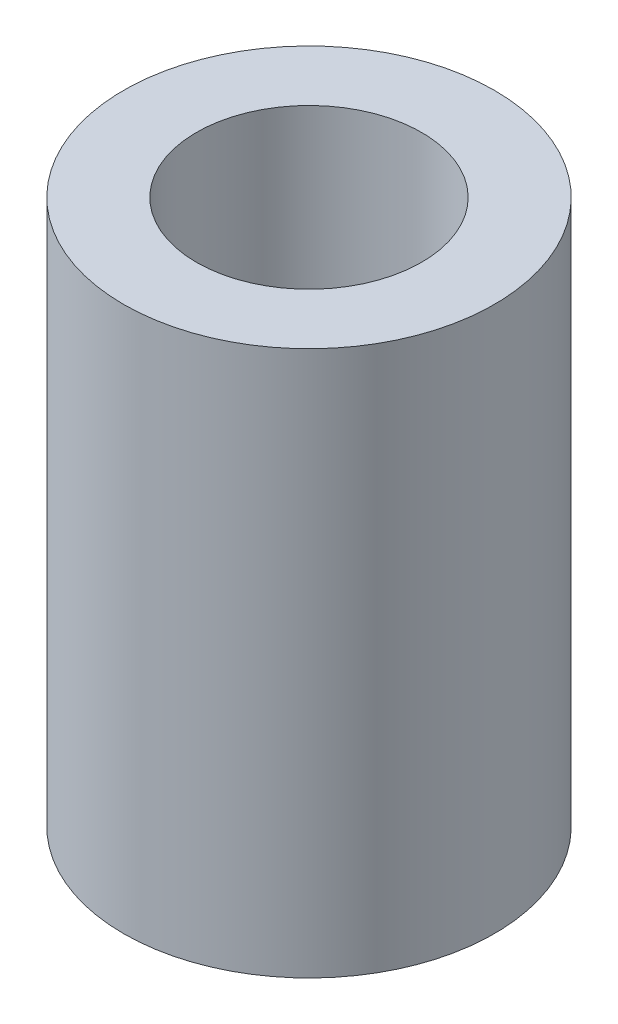
ISO-10303-21;
HEADER;
FILE_DESCRIPTION(('STEP AP214'),'2;1');
FILE_NAME('part.step','',(''),(''),'','','');
FILE_SCHEMA(('AUTOMOTIVE_DESIGN { 1 0 10303 214 1 1 1 1 }'));
ENDSEC;
DATA;
#1=APPLICATION_CONTEXT('core data for automotive mechanical design processes');
#2=APPLICATION_PROTOCOL_DEFINITION('international standard','automotive_design',2000,#1);
#3=PRODUCT_CONTEXT('',#1,'mechanical');
#4=PRODUCT('Part','Part','',(#3));
#5=PRODUCT_RELATED_PRODUCT_CATEGORY('part','',(#4));
#6=PRODUCT_DEFINITION_FORMATION('','',#4);
#7=PRODUCT_DEFINITION_CONTEXT('part definition',#1,'design');
#8=PRODUCT_DEFINITION('design','',#6,#7);
#9=PRODUCT_DEFINITION_SHAPE('','',#8);
#10=(LENGTH_UNIT() NAMED_UNIT(*) SI_UNIT(.MILLI.,.METRE.));
#11=(NAMED_UNIT(*) PLANE_ANGLE_UNIT() SI_UNIT($,.RADIAN.));
#12=(NAMED_UNIT(*) SI_UNIT($,.STERADIAN.) SOLID_ANGLE_UNIT());
#13=UNCERTAINTY_MEASURE_WITH_UNIT(LENGTH_MEASURE(1.E-05),#10,'distance_accuracy_value','');
#14=(GEOMETRIC_REPRESENTATION_CONTEXT(3) GLOBAL_UNCERTAINTY_ASSIGNED_CONTEXT((#13)) GLOBAL_UNIT_ASSIGNED_CONTEXT((#10,
#11,#12)) REPRESENTATION_CONTEXT('',''));
#15=CARTESIAN_POINT('',(0.,0.,0.));
#16=DIRECTION('',(0.,0.,1.));
#17=DIRECTION('',(1.,0.,0.));
#18=AXIS2_PLACEMENT_3D('',#15,#16,#17);
#19=CARTESIAN_POINT('',(0.,20.575016,0.));
#20=DIRECTION('',(0.,1.,0.));
#21=DIRECTION('',(0.,0.,1.));
#22=AXIS2_PLACEMENT_3D('',#19,#20,#21);
#23=PLANE('',#22);
#24=CARTESIAN_POINT('',(0.,20.575016,0.));
#25=DIRECTION('',(0.,1.,0.));
#26=DIRECTION('',(0.,0.,1.));
#27=AXIS2_PLACEMENT_3D('',#24,#25,#26);
#28=CIRCLE('',#27,7.);
#29=CARTESIAN_POINT('',(0.,20.575016,7.));
#30=VERTEX_POINT('',#29);
#31=EDGE_CURVE('E10',#30,#30,#28,.T.);
#32=ORIENTED_EDGE('',*,*,#31,.T.);
#33=EDGE_LOOP('',(#32));
#34=FACE_BOUND('',#33,.T.);
#35=CARTESIAN_POINT('',(0.,20.575016,0.));
#36=DIRECTION('',(0.,1.,0.));
#37=DIRECTION('',(0.,0.,1.));
#38=AXIS2_PLACEMENT_3D('',#35,#36,#37);
#39=CIRCLE('',#38,4.25);
#40=CARTESIAN_POINT('',(0.,20.575016,4.25));
#41=VERTEX_POINT('',#40);
#42=EDGE_CURVE('E48',#41,#41,#39,.T.);
#43=ORIENTED_EDGE('',*,*,#42,.F.);
#44=EDGE_LOOP('',(#43));
#45=FACE_BOUND('',#44,.T.);
#46=ADVANCED_FACE('F37',(#34,#45),#23,.T.);
#47=CARTESIAN_POINT('',(0.,0.,0.));
#48=DIRECTION('',(0.,1.,0.));
#49=DIRECTION('',(0.,0.,1.));
#50=AXIS2_PLACEMENT_3D('',#47,#48,#49);
#51=PLANE('',#50);
#52=CARTESIAN_POINT('',(0.,0.,0.));
#53=DIRECTION('',(0.,1.,0.));
#54=DIRECTION('',(0.,0.,1.));
#55=AXIS2_PLACEMENT_3D('',#52,#53,#54);
#56=CIRCLE('',#55,7.);
#57=CARTESIAN_POINT('',(0.,0.,7.));
#58=VERTEX_POINT('',#57);
#59=EDGE_CURVE('E41',#58,#58,#56,.T.);
#60=ORIENTED_EDGE('',*,*,#59,.F.);
#61=EDGE_LOOP('',(#60));
#62=FACE_BOUND('',#61,.T.);
#63=CARTESIAN_POINT('',(0.,0.,0.));
#64=DIRECTION('',(0.,1.,0.));
#65=DIRECTION('',(0.,0.,1.));
#66=AXIS2_PLACEMENT_3D('',#63,#64,#65);
#67=CIRCLE('',#66,4.25);
#68=CARTESIAN_POINT('',(0.,0.,4.25));
#69=VERTEX_POINT('',#68);
#70=EDGE_CURVE('E50',#69,#69,#67,.T.);
#71=ORIENTED_EDGE('',*,*,#70,.T.);
#72=EDGE_LOOP('',(#71));
#73=FACE_BOUND('',#72,.T.);
#74=ADVANCED_FACE('F60',(#62,#73),#51,.F.);
#75=CARTESIAN_POINT('',(0.,20.575016,0.));
#76=DIRECTION('',(0.,-1.,0.));
#77=DIRECTION('',(0.,0.,-1.));
#78=AXIS2_PLACEMENT_3D('',#75,#76,#77);
#79=CYLINDRICAL_SURFACE('',#78,7.);
#80=ORIENTED_EDGE('',*,*,#31,.F.);
#81=EDGE_LOOP('',(#80));
#82=FACE_BOUND('',#81,.T.);
#83=ORIENTED_EDGE('',*,*,#59,.T.);
#84=EDGE_LOOP('',(#83));
#85=FACE_BOUND('',#84,.T.);
#86=ADVANCED_FACE('F39',(#82,#85),#79,.T.);
#87=CARTESIAN_POINT('',(0.,20.575016,0.));
#88=DIRECTION('',(0.,-1.,0.));
#89=DIRECTION('',(0.,0.,-1.));
#90=AXIS2_PLACEMENT_3D('',#87,#88,#89);
#91=CYLINDRICAL_SURFACE('',#90,4.25);
#92=ORIENTED_EDGE('',*,*,#42,.T.);
#93=EDGE_LOOP('',(#92));
#94=FACE_BOUND('',#93,.T.);
#95=ORIENTED_EDGE('',*,*,#70,.F.);
#96=EDGE_LOOP('',(#95));
#97=FACE_BOUND('',#96,.T.);
#98=ADVANCED_FACE('F56',(#94,#97),#91,.F.);
#99=CLOSED_SHELL('',(#46,#74,#86,#98));
#100=MANIFOLD_SOLID_BREP('B2',#99);
#101=ADVANCED_BREP_SHAPE_REPRESENTATION('',(#18,#100),#14);
#102=SHAPE_DEFINITION_REPRESENTATION(#9,#101);
ENDSEC;
END-ISO-10303-21;
